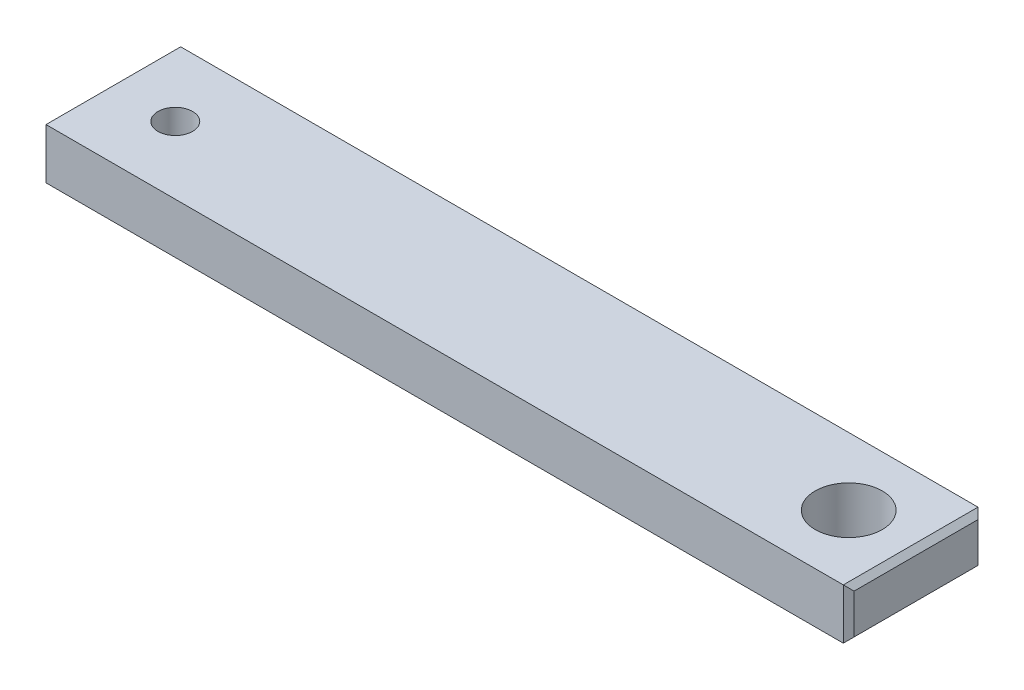
ISO-10303-21;
HEADER;
FILE_DESCRIPTION(('STEP AP214'),'2;1');
FILE_NAME('part.step','',(''),(''),'','','');
FILE_SCHEMA(('AUTOMOTIVE_DESIGN { 1 0 10303 214 1 1 1 1 }'));
ENDSEC;
DATA;
#1=APPLICATION_CONTEXT('core data for automotive mechanical design processes');
#2=APPLICATION_PROTOCOL_DEFINITION('international standard','automotive_design',2000,#1);
#3=PRODUCT_CONTEXT('',#1,'mechanical');
#4=PRODUCT('Part','Part','',(#3));
#5=PRODUCT_RELATED_PRODUCT_CATEGORY('part','',(#4));
#6=PRODUCT_DEFINITION_FORMATION('','',#4);
#7=PRODUCT_DEFINITION_CONTEXT('part definition',#1,'design');
#8=PRODUCT_DEFINITION('design','',#6,#7);
#9=PRODUCT_DEFINITION_SHAPE('','',#8);
#10=(LENGTH_UNIT() NAMED_UNIT(*) SI_UNIT(.MILLI.,.METRE.));
#11=(NAMED_UNIT(*) PLANE_ANGLE_UNIT() SI_UNIT($,.RADIAN.));
#12=(NAMED_UNIT(*) SI_UNIT($,.STERADIAN.) SOLID_ANGLE_UNIT());
#13=UNCERTAINTY_MEASURE_WITH_UNIT(LENGTH_MEASURE(1.E-05),#10,'distance_accuracy_value','');
#14=(GEOMETRIC_REPRESENTATION_CONTEXT(3) GLOBAL_UNCERTAINTY_ASSIGNED_CONTEXT((#13)) GLOBAL_UNIT_ASSIGNED_CONTEXT((#10,
#11,#12)) REPRESENTATION_CONTEXT('',''));
#15=CARTESIAN_POINT('',(0.,0.,0.));
#16=DIRECTION('',(0.,0.,1.));
#17=DIRECTION('',(1.,0.,0.));
#18=AXIS2_PLACEMENT_3D('',#15,#16,#17);
#19=CARTESIAN_POINT('',(0.,4.7625,6.34999999999999));
#20=DIRECTION('',(0.,0.,-1.));
#21=DIRECTION('',(-1.,0.,0.));
#22=AXIS2_PLACEMENT_3D('',#19,#20,#21);
#23=PLANE('',#22);
#24=DIRECTION('',(1.,0.,0.));
#25=VECTOR('',#24,1.);
#26=CARTESIAN_POINT('',(0.,4.7625,6.34999999999999));
#27=LINE('',#26,#25);
#28=CARTESIAN_POINT('',(-69.342,4.7625,6.34999999999999));
#29=VERTEX_POINT('',#28);
#30=CARTESIAN_POINT('',(5.84199999999999,4.7625,6.34999999999999));
#31=VERTEX_POINT('',#30);
#32=EDGE_CURVE('E199',#29,#31,#27,.T.);
#33=ORIENTED_EDGE('',*,*,#32,.F.);
#34=DIRECTION('',(0.,-1.,0.));
#35=VECTOR('',#34,1.);
#36=CARTESIAN_POINT('',(-69.342,4.7625,6.34999999999999));
#37=LINE('',#36,#35);
#38=CARTESIAN_POINT('',(-69.342,0.,6.34999999999999));
#39=VERTEX_POINT('',#38);
#40=EDGE_CURVE('E157',#29,#39,#37,.T.);
#41=ORIENTED_EDGE('',*,*,#40,.T.);
#42=DIRECTION('',(1.,0.,0.));
#43=VECTOR('',#42,1.);
#44=CARTESIAN_POINT('',(0.,0.,6.34999999999999));
#45=LINE('',#44,#43);
#46=CARTESIAN_POINT('',(5.84199999999999,0.,6.34999999999999));
#47=VERTEX_POINT('',#46);
#48=EDGE_CURVE('E200',#39,#47,#45,.T.);
#49=ORIENTED_EDGE('',*,*,#48,.T.);
#50=DIRECTION('',(0.,1.,0.));
#51=VECTOR('',#50,1.);
#52=CARTESIAN_POINT('',(5.84199999999999,4.7625,6.34999999999999));
#53=LINE('',#52,#51);
#54=EDGE_CURVE('E154',#47,#31,#53,.T.);
#55=ORIENTED_EDGE('',*,*,#54,.T.);
#56=EDGE_LOOP('',(#33,#41,#49,#55));
#57=FACE_BOUND('',#56,.T.);
#58=ADVANCED_FACE('F52',(#57),#23,.F.);
#59=CARTESIAN_POINT('',(6.34999999999999,4.7625,0.));
#60=DIRECTION('',(1.,0.,0.));
#61=DIRECTION('',(0.,0.,-1.));
#62=AXIS2_PLACEMENT_3D('',#59,#60,#61);
#63=PLANE('',#62);
#64=DIRECTION('',(0.,0.,1.));
#65=VECTOR('',#64,1.);
#66=CARTESIAN_POINT('',(6.34999999999999,4.25449999999999,0.));
#67=LINE('',#66,#65);
#68=CARTESIAN_POINT('',(6.34999999999999,4.25449999999999,-5.84199999999999));
#69=VERTEX_POINT('',#68);
#70=CARTESIAN_POINT('',(6.34999999999997,4.25449999999999,5.84199999999999));
#71=VERTEX_POINT('',#70);
#72=EDGE_CURVE('E61',#69,#71,#67,.T.);
#73=ORIENTED_EDGE('',*,*,#72,.T.);
#74=DIRECTION('',(0.,-1.,0.));
#75=VECTOR('',#74,1.);
#76=CARTESIAN_POINT('',(6.34999999999997,0.,5.84199999999999));
#77=LINE('',#76,#75);
#78=CARTESIAN_POINT('',(6.34999999999997,0.508000000000008,5.84199999999999));
#79=VERTEX_POINT('',#78);
#80=EDGE_CURVE('E13',#71,#79,#77,.T.);
#81=ORIENTED_EDGE('',*,*,#80,.T.);
#82=DIRECTION('',(0.,0.,-1.));
#83=VECTOR('',#82,1.);
#84=CARTESIAN_POINT('',(6.34999999999999,0.508000000000008,-6.34999999999999));
#85=LINE('',#84,#83);
#86=CARTESIAN_POINT('',(6.34999999999999,0.508000000000008,-5.84199999999999));
#87=VERTEX_POINT('',#86);
#88=EDGE_CURVE('E163',#79,#87,#85,.T.);
#89=ORIENTED_EDGE('',*,*,#88,.T.);
#90=DIRECTION('',(0.,1.,0.));
#91=VECTOR('',#90,1.);
#92=CARTESIAN_POINT('',(6.34999999999999,4.7625,-5.84199999999999));
#93=LINE('',#92,#91);
#94=EDGE_CURVE('E72',#87,#69,#93,.T.);
#95=ORIENTED_EDGE('',*,*,#94,.T.);
#96=EDGE_LOOP('',(#73,#81,#89,#95));
#97=FACE_BOUND('',#96,.T.);
#98=ADVANCED_FACE('F252',(#97),#63,.T.);
#99=CARTESIAN_POINT('',(0.,4.7625,-6.34999999999999));
#100=DIRECTION('',(0.,0.,-1.));
#101=DIRECTION('',(-1.,0.,0.));
#102=AXIS2_PLACEMENT_3D('',#99,#100,#101);
#103=PLANE('',#102);
#104=DIRECTION('',(1.,0.,0.));
#105=VECTOR('',#104,1.);
#106=CARTESIAN_POINT('',(0.,0.,-6.34999999999999));
#107=LINE('',#106,#105);
#108=CARTESIAN_POINT('',(-69.342,0.,-6.34999999999999));
#109=VERTEX_POINT('',#108);
#110=CARTESIAN_POINT('',(5.84199999999999,0.,-6.34999999999999));
#111=VERTEX_POINT('',#110);
#112=EDGE_CURVE('E193',#109,#111,#107,.T.);
#113=ORIENTED_EDGE('',*,*,#112,.F.);
#114=DIRECTION('',(0.,1.,0.));
#115=VECTOR('',#114,1.);
#116=CARTESIAN_POINT('',(-69.342,4.7625,-6.34999999999999));
#117=LINE('',#116,#115);
#118=CARTESIAN_POINT('',(-69.342,4.7625,-6.34999999999999));
#119=VERTEX_POINT('',#118);
#120=EDGE_CURVE('E124',#109,#119,#117,.T.);
#121=ORIENTED_EDGE('',*,*,#120,.T.);
#122=DIRECTION('',(1.,0.,0.));
#123=VECTOR('',#122,1.);
#124=CARTESIAN_POINT('',(0.,4.7625,-6.34999999999999));
#125=LINE('',#124,#123);
#126=CARTESIAN_POINT('',(5.84199999999999,4.7625,-6.34999999999999));
#127=VERTEX_POINT('',#126);
#128=EDGE_CURVE('E137',#119,#127,#125,.T.);
#129=ORIENTED_EDGE('',*,*,#128,.T.);
#130=DIRECTION('',(0.,-1.,0.));
#131=VECTOR('',#130,1.);
#132=CARTESIAN_POINT('',(5.84199999999999,4.7625,-6.34999999999999));
#133=LINE('',#132,#131);
#134=EDGE_CURVE('E143',#127,#111,#133,.T.);
#135=ORIENTED_EDGE('',*,*,#134,.T.);
#136=EDGE_LOOP('',(#113,#121,#129,#135));
#137=FACE_BOUND('',#136,.T.);
#138=ADVANCED_FACE('F192',(#137),#103,.T.);
#139=CARTESIAN_POINT('',(-69.85,4.7625,0.));
#140=DIRECTION('',(1.,0.,0.));
#141=DIRECTION('',(0.,0.,-1.));
#142=AXIS2_PLACEMENT_3D('',#139,#140,#141);
#143=PLANE('',#142);
#144=DIRECTION('',(0.,0.,-1.));
#145=VECTOR('',#144,1.);
#146=CARTESIAN_POINT('',(-69.85,4.2545,-6.35000000000001));
#147=LINE('',#146,#145);
#148=CARTESIAN_POINT('',(-69.85,4.2545,5.84200000000001));
#149=VERTEX_POINT('',#148);
#150=CARTESIAN_POINT('',(-69.85,4.2545,-5.842));
#151=VERTEX_POINT('',#150);
#152=EDGE_CURVE('E141',#149,#151,#147,.T.);
#153=ORIENTED_EDGE('',*,*,#152,.T.);
#154=DIRECTION('',(0.,-1.,0.));
#155=VECTOR('',#154,1.);
#156=CARTESIAN_POINT('',(-69.85,0.,-5.842));
#157=LINE('',#156,#155);
#158=CARTESIAN_POINT('',(-69.85,0.507999999999995,-5.842));
#159=VERTEX_POINT('',#158);
#160=EDGE_CURVE('E122',#151,#159,#157,.T.);
#161=ORIENTED_EDGE('',*,*,#160,.T.);
#162=DIRECTION('',(0.,0.,1.));
#163=VECTOR('',#162,1.);
#164=CARTESIAN_POINT('',(-69.85,0.507999999999995,0.));
#165=LINE('',#164,#163);
#166=CARTESIAN_POINT('',(-69.85,0.507999999999995,5.84200000000001));
#167=VERTEX_POINT('',#166);
#168=EDGE_CURVE('E130',#159,#167,#165,.T.);
#169=ORIENTED_EDGE('',*,*,#168,.T.);
#170=DIRECTION('',(0.,1.,0.));
#171=VECTOR('',#170,1.);
#172=CARTESIAN_POINT('',(-69.85,4.7625,5.84200000000001));
#173=LINE('',#172,#171);
#174=EDGE_CURVE('E136',#167,#149,#173,.T.);
#175=ORIENTED_EDGE('',*,*,#174,.T.);
#176=EDGE_LOOP('',(#153,#161,#169,#175));
#177=FACE_BOUND('',#176,.T.);
#178=ADVANCED_FACE('F139',(#177),#143,.F.);
#179=CARTESIAN_POINT('',(0.,4.7625,0.));
#180=DIRECTION('',(0.,1.,0.));
#181=DIRECTION('',(0.,0.,1.));
#182=AXIS2_PLACEMENT_3D('',#179,#180,#181);
#183=PLANE('',#182);
#184=CARTESIAN_POINT('',(0.,4.7625,0.));
#185=DIRECTION('',(0.,1.,0.));
#186=DIRECTION('',(0.,0.,1.));
#187=AXIS2_PLACEMENT_3D('',#184,#185,#186);
#188=CIRCLE('',#187,3.1623);
#189=CARTESIAN_POINT('',(0.,4.7625,3.1623));
#190=VERTEX_POINT('',#189);
#191=EDGE_CURVE('E172',#190,#190,#188,.T.);
#192=ORIENTED_EDGE('',*,*,#191,.F.);
#193=EDGE_LOOP('',(#192));
#194=FACE_BOUND('',#193,.T.);
#195=CARTESIAN_POINT('',(-63.5,4.7625,0.));
#196=DIRECTION('',(0.,1.,0.));
#197=DIRECTION('',(0.,0.,1.));
#198=AXIS2_PLACEMENT_3D('',#195,#196,#197);
#199=CIRCLE('',#198,1.63195);
#200=CARTESIAN_POINT('',(-63.5,4.7625,1.63195));
#201=VERTEX_POINT('',#200);
#202=EDGE_CURVE('E220',#201,#201,#199,.T.);
#203=ORIENTED_EDGE('',*,*,#202,.F.);
#204=EDGE_LOOP('',(#203));
#205=FACE_BOUND('',#204,.T.);
#206=ORIENTED_EDGE('',*,*,#128,.F.);
#207=DIRECTION('',(0.,0.,1.));
#208=VECTOR('',#207,1.);
#209=CARTESIAN_POINT('',(-69.342,4.7625,6.34999999999999));
#210=LINE('',#209,#208);
#211=EDGE_CURVE('E152',#119,#29,#210,.T.);
#212=ORIENTED_EDGE('',*,*,#211,.T.);
#213=ORIENTED_EDGE('',*,*,#32,.T.);
#214=DIRECTION('',(0.,0.,-1.));
#215=VECTOR('',#214,1.);
#216=CARTESIAN_POINT('',(5.84200000000001,4.7625,0.));
#217=LINE('',#216,#215);
#218=EDGE_CURVE('E150',#31,#127,#217,.T.);
#219=ORIENTED_EDGE('',*,*,#218,.T.);
#220=EDGE_LOOP('',(#206,#212,#213,#219));
#221=FACE_BOUND('',#220,.T.);
#222=ADVANCED_FACE('F216',(#194,#205,#221),#183,.T.);
#223=CARTESIAN_POINT('',(0.,0.,0.));
#224=DIRECTION('',(0.,1.,0.));
#225=DIRECTION('',(0.,0.,1.));
#226=AXIS2_PLACEMENT_3D('',#223,#224,#225);
#227=PLANE('',#226);
#228=CARTESIAN_POINT('',(0.,0.,0.));
#229=DIRECTION('',(0.,1.,0.));
#230=DIRECTION('',(0.,0.,1.));
#231=AXIS2_PLACEMENT_3D('',#228,#229,#230);
#232=CIRCLE('',#231,3.1623);
#233=CARTESIAN_POINT('',(0.,0.,3.1623));
#234=VERTEX_POINT('',#233);
#235=EDGE_CURVE('E223',#234,#234,#232,.T.);
#236=ORIENTED_EDGE('',*,*,#235,.T.);
#237=EDGE_LOOP('',(#236));
#238=FACE_BOUND('',#237,.T.);
#239=CARTESIAN_POINT('',(-63.5,0.,0.));
#240=DIRECTION('',(0.,1.,0.));
#241=DIRECTION('',(0.,0.,1.));
#242=AXIS2_PLACEMENT_3D('',#239,#240,#241);
#243=CIRCLE('',#242,1.63195);
#244=CARTESIAN_POINT('',(-63.5,0.,1.63195));
#245=VERTEX_POINT('',#244);
#246=EDGE_CURVE('E204',#245,#245,#243,.T.);
#247=ORIENTED_EDGE('',*,*,#246,.T.);
#248=EDGE_LOOP('',(#247));
#249=FACE_BOUND('',#248,.T.);
#250=ORIENTED_EDGE('',*,*,#48,.F.);
#251=DIRECTION('',(0.,0.,-1.));
#252=VECTOR('',#251,1.);
#253=CARTESIAN_POINT('',(-69.342,0.,0.));
#254=LINE('',#253,#252);
#255=EDGE_CURVE('E161',#39,#109,#254,.T.);
#256=ORIENTED_EDGE('',*,*,#255,.T.);
#257=ORIENTED_EDGE('',*,*,#112,.T.);
#258=DIRECTION('',(0.,0.,1.));
#259=VECTOR('',#258,1.);
#260=CARTESIAN_POINT('',(5.84199999999999,0.,6.34999999999999));
#261=LINE('',#260,#259);
#262=EDGE_CURVE('E159',#111,#47,#261,.T.);
#263=ORIENTED_EDGE('',*,*,#262,.T.);
#264=EDGE_LOOP('',(#250,#256,#257,#263));
#265=FACE_BOUND('',#264,.T.);
#266=ADVANCED_FACE('F197',(#238,#249,#265),#227,.F.);
#267=CARTESIAN_POINT('',(-63.5,4.7625,0.));
#268=DIRECTION('',(0.,1.,0.));
#269=DIRECTION('',(0.,0.,1.));
#270=AXIS2_PLACEMENT_3D('',#267,#268,#269);
#271=CYLINDRICAL_SURFACE('',#270,1.63195);
#272=ORIENTED_EDGE('',*,*,#246,.F.);
#273=EDGE_LOOP('',(#272));
#274=FACE_BOUND('',#273,.T.);
#275=ORIENTED_EDGE('',*,*,#202,.T.);
#276=EDGE_LOOP('',(#275));
#277=FACE_BOUND('',#276,.T.);
#278=ADVANCED_FACE('F234',(#274,#277),#271,.F.);
#279=CARTESIAN_POINT('',(0.,0.,0.));
#280=DIRECTION('',(0.,1.,0.));
#281=DIRECTION('',(0.,0.,1.));
#282=AXIS2_PLACEMENT_3D('',#279,#280,#281);
#283=CYLINDRICAL_SURFACE('',#282,3.1623);
#284=ORIENTED_EDGE('',*,*,#235,.F.);
#285=EDGE_LOOP('',(#284));
#286=FACE_BOUND('',#285,.T.);
#287=ORIENTED_EDGE('',*,*,#191,.T.);
#288=EDGE_LOOP('',(#287));
#289=FACE_BOUND('',#288,.T.);
#290=ADVANCED_FACE('F231',(#286,#289),#283,.F.);
#291=CARTESIAN_POINT('',(-69.342,4.7625,6.34999999999999));
#292=DIRECTION('',(0.707106781186538,0.,-0.707106781186556));
#293=DIRECTION('',(0.,-1.,0.));
#294=AXIS2_PLACEMENT_3D('',#291,#292,#293);
#295=PLANE('',#294);
#296=DIRECTION('',(-0.577350269189631,0.577350269189631,-0.577350269189616));
#297=VECTOR('',#296,1.);
#298=CARTESIAN_POINT('',(-71.7973333333333,2.45533333333331,3.89466666666674));
#299=LINE('',#298,#297);
#300=EDGE_CURVE('E133',#39,#167,#299,.T.);
#301=ORIENTED_EDGE('',*,*,#300,.F.);
#302=ORIENTED_EDGE('',*,*,#40,.F.);
#303=DIRECTION('',(0.577350269189631,0.577350269189631,0.577350269189616));
#304=VECTOR('',#303,1.);
#305=CARTESIAN_POINT('',(-69.342,4.76250000000001,6.34999999999999));
#306=LINE('',#305,#304);
#307=EDGE_CURVE('E169',#149,#29,#306,.T.);
#308=ORIENTED_EDGE('',*,*,#307,.F.);
#309=ORIENTED_EDGE('',*,*,#174,.F.);
#310=EDGE_LOOP('',(#301,#302,#308,#309));
#311=FACE_BOUND('',#310,.T.);
#312=ADVANCED_FACE('F210',(#311),#295,.F.);
#313=CARTESIAN_POINT('',(-69.342,4.7625,0.));
#314=DIRECTION('',(-0.707106781186548,0.707106781186547,0.));
#315=DIRECTION('',(0.,0.,-1.));
#316=AXIS2_PLACEMENT_3D('',#313,#314,#315);
#317=PLANE('',#316);
#318=ORIENTED_EDGE('',*,*,#307,.T.);
#319=ORIENTED_EDGE('',*,*,#211,.F.);
#320=DIRECTION('',(-0.577350269189631,-0.577350269189631,0.577350269189616));
#321=VECTOR('',#320,1.);
#322=CARTESIAN_POINT('',(-71.4586666666666,2.64583333333335,-4.23333333333339));
#323=LINE('',#322,#321);
#324=EDGE_CURVE('E127',#151,#119,#323,.F.);
#325=ORIENTED_EDGE('',*,*,#324,.F.);
#326=ORIENTED_EDGE('',*,*,#152,.F.);
#327=EDGE_LOOP('',(#318,#319,#325,#326));
#328=FACE_BOUND('',#327,.T.);
#329=ADVANCED_FACE('F213',(#328),#317,.T.);
#330=CARTESIAN_POINT('',(-69.85,0.507999999999995,0.));
#331=DIRECTION('',(0.707106781186548,0.707106781186547,0.));
#332=DIRECTION('',(0.,0.,1.));
#333=AXIS2_PLACEMENT_3D('',#330,#331,#332);
#334=PLANE('',#333);
#335=ORIENTED_EDGE('',*,*,#300,.T.);
#336=ORIENTED_EDGE('',*,*,#168,.F.);
#337=DIRECTION('',(-0.577350269189631,0.577350269189631,0.577350269189616));
#338=VECTOR('',#337,1.);
#339=CARTESIAN_POINT('',(-71.7973333333333,2.45533333333331,-3.89466666666674));
#340=LINE('',#339,#338);
#341=EDGE_CURVE('E118',#109,#159,#340,.T.);
#342=ORIENTED_EDGE('',*,*,#341,.F.);
#343=ORIENTED_EDGE('',*,*,#255,.F.);
#344=EDGE_LOOP('',(#335,#336,#342,#343));
#345=FACE_BOUND('',#344,.T.);
#346=ADVANCED_FACE('F131',(#345),#334,.F.);
#347=CARTESIAN_POINT('',(-69.85,4.7625,-5.842));
#348=DIRECTION('',(-0.707106781186538,0.,-0.707106781186556));
#349=DIRECTION('',(0.,1.,0.));
#350=AXIS2_PLACEMENT_3D('',#347,#348,#349);
#351=PLANE('',#350);
#352=ORIENTED_EDGE('',*,*,#324,.T.);
#353=ORIENTED_EDGE('',*,*,#120,.F.);
#354=ORIENTED_EDGE('',*,*,#341,.T.);
#355=ORIENTED_EDGE('',*,*,#160,.F.);
#356=EDGE_LOOP('',(#352,#353,#354,#355));
#357=FACE_BOUND('',#356,.T.);
#358=ADVANCED_FACE('F120',(#357),#351,.T.);
#359=CARTESIAN_POINT('',(5.84199999999999,4.7625,-6.34999999999999));
#360=DIRECTION('',(-0.707106781186552,0.,0.707106781186543));
#361=DIRECTION('',(0.,-1.,0.));
#362=AXIS2_PLACEMENT_3D('',#359,#360,#361);
#363=PLANE('',#362);
#364=DIRECTION('',(-0.57735026918962,-0.577350269189628,-0.577350269189628));
#365=VECTOR('',#364,1.);
#366=CARTESIAN_POINT('',(7.95866666666664,2.11666666666669,-4.23333333333331));
#367=LINE('',#366,#365);
#368=EDGE_CURVE('E176',#111,#87,#367,.F.);
#369=ORIENTED_EDGE('',*,*,#368,.F.);
#370=ORIENTED_EDGE('',*,*,#134,.F.);
#371=DIRECTION('',(0.57735026918962,-0.577350269189628,0.577350269189628));
#372=VECTOR('',#371,1.);
#373=CARTESIAN_POINT('',(5.84199999999999,4.7625,-6.34999999999999));
#374=LINE('',#373,#372);
#375=EDGE_CURVE('E56',#69,#127,#374,.F.);
#376=ORIENTED_EDGE('',*,*,#375,.F.);
#377=ORIENTED_EDGE('',*,*,#94,.F.);
#378=EDGE_LOOP('',(#369,#370,#376,#377));
#379=FACE_BOUND('',#378,.T.);
#380=ADVANCED_FACE('F54',(#379),#363,.F.);
#381=CARTESIAN_POINT('',(6.34999999999999,4.25449999999999,0.));
#382=DIRECTION('',(-0.707106781186552,-0.707106781186543,0.));
#383=DIRECTION('',(0.,0.,1.));
#384=AXIS2_PLACEMENT_3D('',#381,#382,#383);
#385=PLANE('',#384);
#386=ORIENTED_EDGE('',*,*,#375,.T.);
#387=ORIENTED_EDGE('',*,*,#218,.F.);
#388=DIRECTION('',(-0.57735026918962,0.577350269189628,0.577350269189628));
#389=VECTOR('',#388,1.);
#390=CARTESIAN_POINT('',(8.29733333333332,2.30716666666664,3.89466666666664));
#391=LINE('',#390,#389);
#392=EDGE_CURVE('E175',#71,#31,#391,.T.);
#393=ORIENTED_EDGE('',*,*,#392,.F.);
#394=ORIENTED_EDGE('',*,*,#72,.F.);
#395=EDGE_LOOP('',(#386,#387,#393,#394));
#396=FACE_BOUND('',#395,.T.);
#397=ADVANCED_FACE('F185',(#396),#385,.F.);
#398=CARTESIAN_POINT('',(5.84200000000001,0.,0.));
#399=DIRECTION('',(0.707106781186552,-0.707106781186543,0.));
#400=DIRECTION('',(0.,0.,-1.));
#401=AXIS2_PLACEMENT_3D('',#398,#399,#400);
#402=PLANE('',#401);
#403=ORIENTED_EDGE('',*,*,#368,.T.);
#404=ORIENTED_EDGE('',*,*,#88,.F.);
#405=DIRECTION('',(-0.57735026918962,-0.577350269189628,0.577350269189628));
#406=VECTOR('',#405,1.);
#407=CARTESIAN_POINT('',(7.95866666666664,2.11666666666669,4.23333333333331));
#408=LINE('',#407,#406);
#409=EDGE_CURVE('E173',#47,#79,#408,.F.);
#410=ORIENTED_EDGE('',*,*,#409,.F.);
#411=ORIENTED_EDGE('',*,*,#262,.F.);
#412=EDGE_LOOP('',(#403,#404,#410,#411));
#413=FACE_BOUND('',#412,.T.);
#414=ADVANCED_FACE('F272',(#413),#402,.T.);
#415=CARTESIAN_POINT('',(6.34999999999997,4.7625,5.84199999999999));
#416=DIRECTION('',(0.707106781186552,0.,0.707106781186543));
#417=DIRECTION('',(0.,1.,0.));
#418=AXIS2_PLACEMENT_3D('',#415,#416,#417);
#419=PLANE('',#418);
#420=ORIENTED_EDGE('',*,*,#392,.T.);
#421=ORIENTED_EDGE('',*,*,#54,.F.);
#422=ORIENTED_EDGE('',*,*,#409,.T.);
#423=ORIENTED_EDGE('',*,*,#80,.F.);
#424=EDGE_LOOP('',(#420,#421,#422,#423));
#425=FACE_BOUND('',#424,.T.);
#426=ADVANCED_FACE('F269',(#425),#419,.T.);
#427=CLOSED_SHELL('',(#58,#98,#138,#178,#222,#266,#278,#290,#312,#329,#346,#358,#380,#397,#414,#426));
#428=MANIFOLD_SOLID_BREP('B2',#427);
#429=ADVANCED_BREP_SHAPE_REPRESENTATION('',(#18,#428),#14);
#430=SHAPE_DEFINITION_REPRESENTATION(#9,#429);
ENDSEC;
END-ISO-10303-21;
